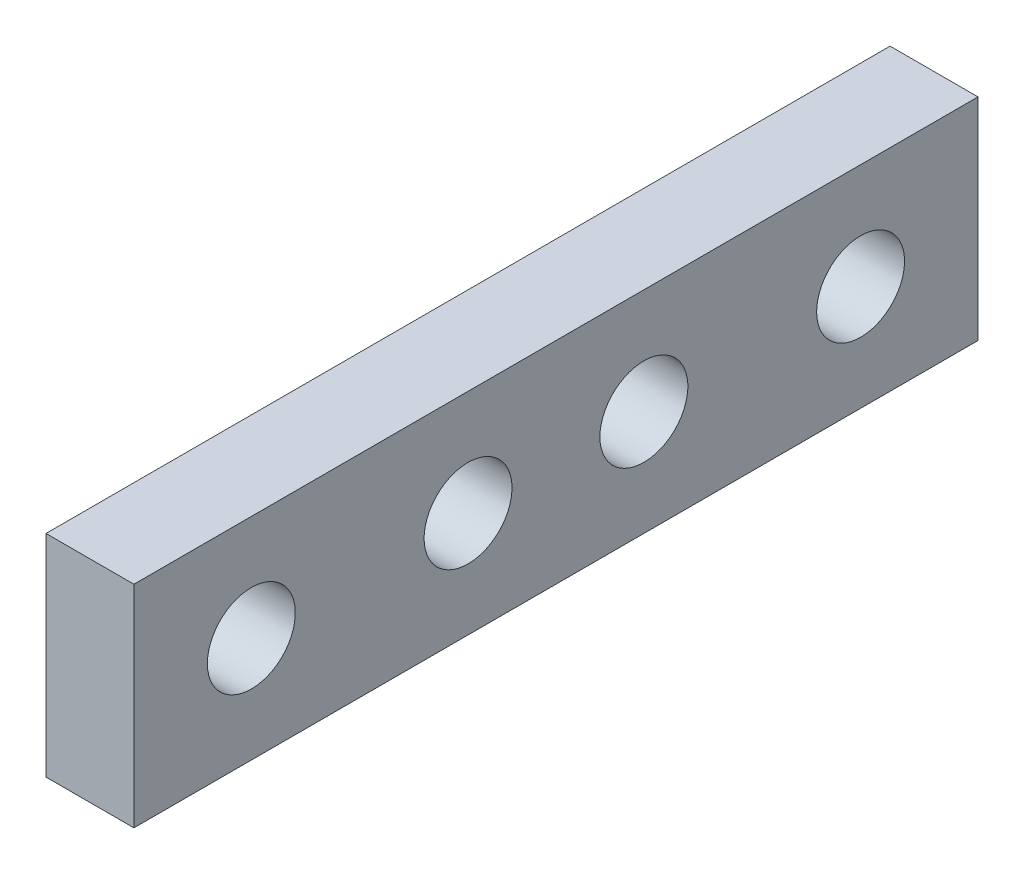
ISO-10303-21;
HEADER;
FILE_DESCRIPTION(('STEP AP214'),'2;1');
FILE_NAME('part.step','',(''),(''),'','','');
FILE_SCHEMA(('AUTOMOTIVE_DESIGN { 1 0 10303 214 1 1 1 1 }'));
ENDSEC;
DATA;
#1=APPLICATION_CONTEXT('core data for automotive mechanical design processes');
#2=APPLICATION_PROTOCOL_DEFINITION('international standard','automotive_design',2000,#1);
#3=PRODUCT_CONTEXT('',#1,'mechanical');
#4=PRODUCT('Part','Part','',(#3));
#5=PRODUCT_RELATED_PRODUCT_CATEGORY('part','',(#4));
#6=PRODUCT_DEFINITION_FORMATION('','',#4);
#7=PRODUCT_DEFINITION_CONTEXT('part definition',#1,'design');
#8=PRODUCT_DEFINITION('design','',#6,#7);
#9=PRODUCT_DEFINITION_SHAPE('','',#8);
#10=(LENGTH_UNIT() NAMED_UNIT(*) SI_UNIT(.MILLI.,.METRE.));
#11=(NAMED_UNIT(*) PLANE_ANGLE_UNIT() SI_UNIT($,.RADIAN.));
#12=(NAMED_UNIT(*) SI_UNIT($,.STERADIAN.) SOLID_ANGLE_UNIT());
#13=UNCERTAINTY_MEASURE_WITH_UNIT(LENGTH_MEASURE(1.E-05),#10,'distance_accuracy_value','');
#14=(GEOMETRIC_REPRESENTATION_CONTEXT(3) GLOBAL_UNCERTAINTY_ASSIGNED_CONTEXT((#13)) GLOBAL_UNIT_ASSIGNED_CONTEXT((#10,
#11,#12)) REPRESENTATION_CONTEXT('',''));
#15=CARTESIAN_POINT('',(0.,0.,0.));
#16=DIRECTION('',(0.,0.,1.));
#17=DIRECTION('',(1.,0.,0.));
#18=AXIS2_PLACEMENT_3D('',#15,#16,#17);
#19=CARTESIAN_POINT('',(1.5875,-3.81,15.24));
#20=DIRECTION('',(-1.,0.,0.));
#21=DIRECTION('',(0.,0.,1.));
#22=AXIS2_PLACEMENT_3D('',#19,#20,#21);
#23=PLANE('',#22);
#24=CARTESIAN_POINT('',(1.5875,0.,-11.));
#25=DIRECTION('',(-1.,0.,0.));
#26=DIRECTION('',(0.,0.,1.));
#27=AXIS2_PLACEMENT_3D('',#24,#25,#26);
#28=CIRCLE('',#27,1.5875);
#29=CARTESIAN_POINT('',(1.5875,0.,-9.4125));
#30=VERTEX_POINT('',#29);
#31=EDGE_CURVE('E149',#30,#30,#28,.T.);
#32=ORIENTED_EDGE('',*,*,#31,.T.);
#33=EDGE_LOOP('',(#32));
#34=FACE_BOUND('',#33,.T.);
#35=CARTESIAN_POINT('',(1.5875,0.,11.));
#36=DIRECTION('',(-1.,0.,0.));
#37=DIRECTION('',(0.,0.,1.));
#38=AXIS2_PLACEMENT_3D('',#35,#36,#37);
#39=CIRCLE('',#38,1.5875);
#40=CARTESIAN_POINT('',(1.5875,0.,12.5875));
#41=VERTEX_POINT('',#40);
#42=EDGE_CURVE('E153',#41,#41,#39,.T.);
#43=ORIENTED_EDGE('',*,*,#42,.T.);
#44=EDGE_LOOP('',(#43));
#45=FACE_BOUND('',#44,.T.);
#46=CARTESIAN_POINT('',(1.5875,0.,-3.175));
#47=DIRECTION('',(-1.,0.,0.));
#48=DIRECTION('',(0.,0.,1.));
#49=AXIS2_PLACEMENT_3D('',#46,#47,#48);
#50=CIRCLE('',#49,1.5875);
#51=CARTESIAN_POINT('',(1.5875,0.,-1.5875));
#52=VERTEX_POINT('',#51);
#53=EDGE_CURVE('E103',#52,#52,#50,.T.);
#54=ORIENTED_EDGE('',*,*,#53,.T.);
#55=EDGE_LOOP('',(#54));
#56=FACE_BOUND('',#55,.T.);
#57=CARTESIAN_POINT('',(1.5875,0.,3.175));
#58=DIRECTION('',(-1.,0.,0.));
#59=DIRECTION('',(0.,0.,1.));
#60=AXIS2_PLACEMENT_3D('',#57,#58,#59);
#61=CIRCLE('',#60,1.5875);
#62=CARTESIAN_POINT('',(1.5875,0.,4.7625));
#63=VERTEX_POINT('',#62);
#64=EDGE_CURVE('E159',#63,#63,#61,.T.);
#65=ORIENTED_EDGE('',*,*,#64,.T.);
#66=EDGE_LOOP('',(#65));
#67=FACE_BOUND('',#66,.T.);
#68=DIRECTION('',(0.,0.,-1.));
#69=VECTOR('',#68,1.);
#70=CARTESIAN_POINT('',(1.5875,-3.81,15.24));
#71=LINE('',#70,#69);
#72=CARTESIAN_POINT('',(1.5875,-3.81,15.24));
#73=VERTEX_POINT('',#72);
#74=CARTESIAN_POINT('',(1.5875,-3.81,-15.24));
#75=VERTEX_POINT('',#74);
#76=EDGE_CURVE('E83',#73,#75,#71,.T.);
#77=ORIENTED_EDGE('',*,*,#76,.T.);
#78=DIRECTION('',(0.,1.,0.));
#79=VECTOR('',#78,1.);
#80=CARTESIAN_POINT('',(1.5875,-3.81,-15.24));
#81=LINE('',#80,#79);
#82=CARTESIAN_POINT('',(1.5875,3.81,-15.24));
#83=VERTEX_POINT('',#82);
#84=EDGE_CURVE('E86',#75,#83,#81,.T.);
#85=ORIENTED_EDGE('',*,*,#84,.T.);
#86=DIRECTION('',(0.,0.,-1.));
#87=VECTOR('',#86,1.);
#88=CARTESIAN_POINT('',(1.5875,3.81,15.24));
#89=LINE('',#88,#87);
#90=CARTESIAN_POINT('',(1.5875,3.81,15.24));
#91=VERTEX_POINT('',#90);
#92=EDGE_CURVE('E11',#91,#83,#89,.T.);
#93=ORIENTED_EDGE('',*,*,#92,.F.);
#94=DIRECTION('',(0.,1.,0.));
#95=VECTOR('',#94,1.);
#96=CARTESIAN_POINT('',(1.5875,-3.81,15.24));
#97=LINE('',#96,#95);
#98=EDGE_CURVE('E88',#73,#91,#97,.T.);
#99=ORIENTED_EDGE('',*,*,#98,.F.);
#100=EDGE_LOOP('',(#77,#85,#93,#99));
#101=FACE_BOUND('',#100,.T.);
#102=ADVANCED_FACE('F43',(#34,#45,#56,#67,#101),#23,.F.);
#103=CARTESIAN_POINT('',(-1.5875,3.81,15.24));
#104=DIRECTION('',(0.,-1.,0.));
#105=DIRECTION('',(0.,0.,-1.));
#106=AXIS2_PLACEMENT_3D('',#103,#104,#105);
#107=PLANE('',#106);
#108=ORIENTED_EDGE('',*,*,#92,.T.);
#109=DIRECTION('',(-1.,0.,0.));
#110=VECTOR('',#109,1.);
#111=CARTESIAN_POINT('',(-1.5875,3.81,-15.24));
#112=LINE('',#111,#110);
#113=CARTESIAN_POINT('',(-1.5875,3.81,-15.24));
#114=VERTEX_POINT('',#113);
#115=EDGE_CURVE('E101',#83,#114,#112,.T.);
#116=ORIENTED_EDGE('',*,*,#115,.T.);
#117=DIRECTION('',(0.,0.,-1.));
#118=VECTOR('',#117,1.);
#119=CARTESIAN_POINT('',(-1.5875,3.81,15.24));
#120=LINE('',#119,#118);
#121=CARTESIAN_POINT('',(-1.5875,3.81,15.24));
#122=VERTEX_POINT('',#121);
#123=EDGE_CURVE('E51',#122,#114,#120,.T.);
#124=ORIENTED_EDGE('',*,*,#123,.F.);
#125=DIRECTION('',(-1.,0.,0.));
#126=VECTOR('',#125,1.);
#127=CARTESIAN_POINT('',(-1.5875,3.81,15.24));
#128=LINE('',#127,#126);
#129=EDGE_CURVE('E117',#91,#122,#128,.T.);
#130=ORIENTED_EDGE('',*,*,#129,.F.);
#131=EDGE_LOOP('',(#108,#116,#124,#130));
#132=FACE_BOUND('',#131,.T.);
#133=ADVANCED_FACE('F130',(#132),#107,.F.);
#134=CARTESIAN_POINT('',(-1.5875,-3.81,15.24));
#135=DIRECTION('',(1.,0.,0.));
#136=DIRECTION('',(0.,0.,-1.));
#137=AXIS2_PLACEMENT_3D('',#134,#135,#136);
#138=PLANE('',#137);
#139=CARTESIAN_POINT('',(-1.5875,0.,-11.));
#140=DIRECTION('',(-1.,0.,0.));
#141=DIRECTION('',(0.,0.,1.));
#142=AXIS2_PLACEMENT_3D('',#139,#140,#141);
#143=CIRCLE('',#142,1.5875);
#144=CARTESIAN_POINT('',(-1.5875,0.,-9.4125));
#145=VERTEX_POINT('',#144);
#146=EDGE_CURVE('E168',#145,#145,#143,.T.);
#147=ORIENTED_EDGE('',*,*,#146,.F.);
#148=EDGE_LOOP('',(#147));
#149=FACE_BOUND('',#148,.T.);
#150=CARTESIAN_POINT('',(-1.5875,0.,11.));
#151=DIRECTION('',(-1.,0.,0.));
#152=DIRECTION('',(0.,0.,1.));
#153=AXIS2_PLACEMENT_3D('',#150,#151,#152);
#154=CIRCLE('',#153,1.5875);
#155=CARTESIAN_POINT('',(-1.5875,0.,12.5875));
#156=VERTEX_POINT('',#155);
#157=EDGE_CURVE('E178',#156,#156,#154,.T.);
#158=ORIENTED_EDGE('',*,*,#157,.F.);
#159=EDGE_LOOP('',(#158));
#160=FACE_BOUND('',#159,.T.);
#161=CARTESIAN_POINT('',(-1.5875,0.,-3.175));
#162=DIRECTION('',(-1.,0.,0.));
#163=DIRECTION('',(0.,0.,1.));
#164=AXIS2_PLACEMENT_3D('',#161,#162,#163);
#165=CIRCLE('',#164,1.5875);
#166=CARTESIAN_POINT('',(-1.5875,0.,-1.5875));
#167=VERTEX_POINT('',#166);
#168=EDGE_CURVE('E166',#167,#167,#165,.T.);
#169=ORIENTED_EDGE('',*,*,#168,.F.);
#170=EDGE_LOOP('',(#169));
#171=FACE_BOUND('',#170,.T.);
#172=CARTESIAN_POINT('',(-1.5875,0.,3.175));
#173=DIRECTION('',(-1.,0.,0.));
#174=DIRECTION('',(0.,0.,1.));
#175=AXIS2_PLACEMENT_3D('',#172,#173,#174);
#176=CIRCLE('',#175,1.5875);
#177=CARTESIAN_POINT('',(-1.5875,0.,4.7625));
#178=VERTEX_POINT('',#177);
#179=EDGE_CURVE('E162',#178,#178,#176,.T.);
#180=ORIENTED_EDGE('',*,*,#179,.F.);
#181=EDGE_LOOP('',(#180));
#182=FACE_BOUND('',#181,.T.);
#183=ORIENTED_EDGE('',*,*,#123,.T.);
#184=DIRECTION('',(0.,-1.,0.));
#185=VECTOR('',#184,1.);
#186=CARTESIAN_POINT('',(-1.5875,-3.81,-15.24));
#187=LINE('',#186,#185);
#188=CARTESIAN_POINT('',(-1.5875,-3.81,-15.24));
#189=VERTEX_POINT('',#188);
#190=EDGE_CURVE('E107',#114,#189,#187,.T.);
#191=ORIENTED_EDGE('',*,*,#190,.T.);
#192=DIRECTION('',(0.,0.,-1.));
#193=VECTOR('',#192,1.);
#194=CARTESIAN_POINT('',(-1.5875,-3.81,15.24));
#195=LINE('',#194,#193);
#196=CARTESIAN_POINT('',(-1.5875,-3.81,15.24));
#197=VERTEX_POINT('',#196);
#198=EDGE_CURVE('E92',#197,#189,#195,.T.);
#199=ORIENTED_EDGE('',*,*,#198,.F.);
#200=DIRECTION('',(0.,-1.,0.));
#201=VECTOR('',#200,1.);
#202=CARTESIAN_POINT('',(-1.5875,-3.81,15.24));
#203=LINE('',#202,#201);
#204=EDGE_CURVE('E63',#122,#197,#203,.T.);
#205=ORIENTED_EDGE('',*,*,#204,.F.);
#206=EDGE_LOOP('',(#183,#191,#199,#205));
#207=FACE_BOUND('',#206,.T.);
#208=ADVANCED_FACE('F128',(#149,#160,#171,#182,#207),#138,.F.);
#209=CARTESIAN_POINT('',(-1.5875,-3.81,15.24));
#210=DIRECTION('',(0.,1.,0.));
#211=DIRECTION('',(0.,0.,1.));
#212=AXIS2_PLACEMENT_3D('',#209,#210,#211);
#213=PLANE('',#212);
#214=ORIENTED_EDGE('',*,*,#198,.T.);
#215=DIRECTION('',(1.,0.,0.));
#216=VECTOR('',#215,1.);
#217=CARTESIAN_POINT('',(-1.5875,-3.81,-15.24));
#218=LINE('',#217,#216);
#219=EDGE_CURVE('E98',#189,#75,#218,.T.);
#220=ORIENTED_EDGE('',*,*,#219,.T.);
#221=ORIENTED_EDGE('',*,*,#76,.F.);
#222=DIRECTION('',(1.,0.,0.));
#223=VECTOR('',#222,1.);
#224=CARTESIAN_POINT('',(-1.5875,-3.81,15.24));
#225=LINE('',#224,#223);
#226=EDGE_CURVE('E58',#197,#73,#225,.T.);
#227=ORIENTED_EDGE('',*,*,#226,.F.);
#228=EDGE_LOOP('',(#214,#220,#221,#227));
#229=FACE_BOUND('',#228,.T.);
#230=ADVANCED_FACE('F105',(#229),#213,.F.);
#231=CARTESIAN_POINT('',(0.,0.,15.24));
#232=DIRECTION('',(0.,0.,-1.));
#233=DIRECTION('',(-1.,0.,0.));
#234=AXIS2_PLACEMENT_3D('',#231,#232,#233);
#235=PLANE('',#234);
#236=ORIENTED_EDGE('',*,*,#98,.T.);
#237=ORIENTED_EDGE('',*,*,#129,.T.);
#238=ORIENTED_EDGE('',*,*,#204,.T.);
#239=ORIENTED_EDGE('',*,*,#226,.T.);
#240=EDGE_LOOP('',(#236,#237,#238,#239));
#241=FACE_BOUND('',#240,.T.);
#242=ADVANCED_FACE('F131',(#241),#235,.F.);
#243=CARTESIAN_POINT('',(0.,0.,-15.24));
#244=DIRECTION('',(0.,0.,1.));
#245=DIRECTION('',(-1.,0.,0.));
#246=AXIS2_PLACEMENT_3D('',#243,#244,#245);
#247=PLANE('',#246);
#248=ORIENTED_EDGE('',*,*,#84,.F.);
#249=ORIENTED_EDGE('',*,*,#219,.F.);
#250=ORIENTED_EDGE('',*,*,#190,.F.);
#251=ORIENTED_EDGE('',*,*,#115,.F.);
#252=EDGE_LOOP('',(#248,#249,#250,#251));
#253=FACE_BOUND('',#252,.T.);
#254=ADVANCED_FACE('F96',(#253),#247,.F.);
#255=CARTESIAN_POINT('',(1.5875,0.,3.175));
#256=DIRECTION('',(-1.,0.,0.));
#257=DIRECTION('',(0.,0.,1.));
#258=AXIS2_PLACEMENT_3D('',#255,#256,#257);
#259=CYLINDRICAL_SURFACE('',#258,1.5875);
#260=ORIENTED_EDGE('',*,*,#64,.F.);
#261=EDGE_LOOP('',(#260));
#262=FACE_BOUND('',#261,.T.);
#263=ORIENTED_EDGE('',*,*,#179,.T.);
#264=EDGE_LOOP('',(#263));
#265=FACE_BOUND('',#264,.T.);
#266=ADVANCED_FACE('F138',(#262,#265),#259,.F.);
#267=CARTESIAN_POINT('',(1.5875,0.,-3.175));
#268=DIRECTION('',(-1.,0.,0.));
#269=DIRECTION('',(0.,0.,1.));
#270=AXIS2_PLACEMENT_3D('',#267,#268,#269);
#271=CYLINDRICAL_SURFACE('',#270,1.5875);
#272=ORIENTED_EDGE('',*,*,#53,.F.);
#273=EDGE_LOOP('',(#272));
#274=FACE_BOUND('',#273,.T.);
#275=ORIENTED_EDGE('',*,*,#168,.T.);
#276=EDGE_LOOP('',(#275));
#277=FACE_BOUND('',#276,.T.);
#278=ADVANCED_FACE('F198',(#274,#277),#271,.F.);
#279=CARTESIAN_POINT('',(1.5875,0.,11.));
#280=DIRECTION('',(-1.,0.,0.));
#281=DIRECTION('',(0.,0.,1.));
#282=AXIS2_PLACEMENT_3D('',#279,#280,#281);
#283=CYLINDRICAL_SURFACE('',#282,1.5875);
#284=ORIENTED_EDGE('',*,*,#42,.F.);
#285=EDGE_LOOP('',(#284));
#286=FACE_BOUND('',#285,.T.);
#287=ORIENTED_EDGE('',*,*,#157,.T.);
#288=EDGE_LOOP('',(#287));
#289=FACE_BOUND('',#288,.T.);
#290=ADVANCED_FACE('F203',(#286,#289),#283,.F.);
#291=CARTESIAN_POINT('',(1.5875,0.,-11.));
#292=DIRECTION('',(-1.,0.,0.));
#293=DIRECTION('',(0.,0.,1.));
#294=AXIS2_PLACEMENT_3D('',#291,#292,#293);
#295=CYLINDRICAL_SURFACE('',#294,1.5875);
#296=ORIENTED_EDGE('',*,*,#31,.F.);
#297=EDGE_LOOP('',(#296));
#298=FACE_BOUND('',#297,.T.);
#299=ORIENTED_EDGE('',*,*,#146,.T.);
#300=EDGE_LOOP('',(#299));
#301=FACE_BOUND('',#300,.T.);
#302=ADVANCED_FACE('F186',(#298,#301),#295,.F.);
#303=CLOSED_SHELL('',(#102,#133,#208,#230,#242,#254,#266,#278,#290,#302));
#304=MANIFOLD_SOLID_BREP('B2',#303);
#305=ADVANCED_BREP_SHAPE_REPRESENTATION('',(#18,#304),#14);
#306=SHAPE_DEFINITION_REPRESENTATION(#9,#305);
ENDSEC;
END-ISO-10303-21;
